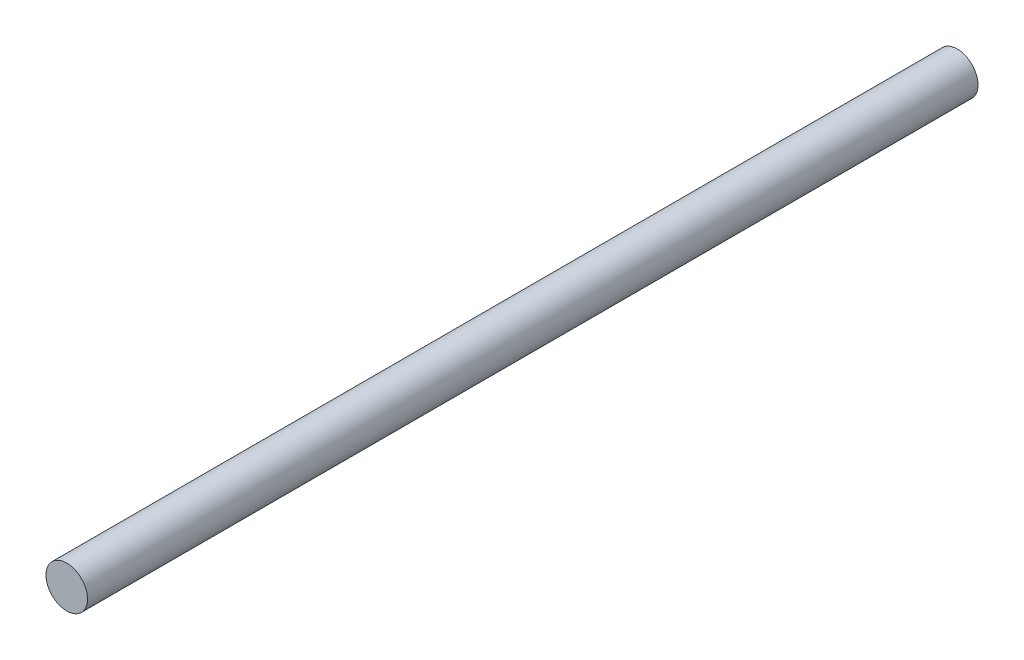
ISO-10303-21;
HEADER;
FILE_DESCRIPTION(('STEP AP214'),'2;1');
FILE_NAME('part.step','',(''),(''),'','','');
FILE_SCHEMA(('AUTOMOTIVE_DESIGN { 1 0 10303 214 1 1 1 1 }'));
ENDSEC;
DATA;
#1=APPLICATION_CONTEXT('core data for automotive mechanical design processes');
#2=APPLICATION_PROTOCOL_DEFINITION('international standard','automotive_design',2000,#1);
#3=PRODUCT_CONTEXT('',#1,'mechanical');
#4=PRODUCT('Part','Part','',(#3));
#5=PRODUCT_RELATED_PRODUCT_CATEGORY('part','',(#4));
#6=PRODUCT_DEFINITION_FORMATION('','',#4);
#7=PRODUCT_DEFINITION_CONTEXT('part definition',#1,'design');
#8=PRODUCT_DEFINITION('design','',#6,#7);
#9=PRODUCT_DEFINITION_SHAPE('','',#8);
#10=(LENGTH_UNIT() NAMED_UNIT(*) SI_UNIT(.MILLI.,.METRE.));
#11=(NAMED_UNIT(*) PLANE_ANGLE_UNIT() SI_UNIT($,.RADIAN.));
#12=(NAMED_UNIT(*) SI_UNIT($,.STERADIAN.) SOLID_ANGLE_UNIT());
#13=UNCERTAINTY_MEASURE_WITH_UNIT(LENGTH_MEASURE(1.E-05),#10,'distance_accuracy_value','');
#14=(GEOMETRIC_REPRESENTATION_CONTEXT(3) GLOBAL_UNCERTAINTY_ASSIGNED_CONTEXT((#13)) GLOBAL_UNIT_ASSIGNED_CONTEXT((#10,
#11,#12)) REPRESENTATION_CONTEXT('',''));
#15=CARTESIAN_POINT('',(0.,0.,0.));
#16=DIRECTION('',(0.,0.,1.));
#17=DIRECTION('',(1.,0.,0.));
#18=AXIS2_PLACEMENT_3D('',#15,#16,#17);
#19=CARTESIAN_POINT('',(0.,0.,38.1));
#20=DIRECTION('',(0.,0.,-1.));
#21=DIRECTION('',(-1.,0.,0.));
#22=AXIS2_PLACEMENT_3D('',#19,#20,#21);
#23=CYLINDRICAL_SURFACE('',#22,0.889);
#24=CARTESIAN_POINT('',(0.,0.,38.1));
#25=DIRECTION('',(0.,0.,1.));
#26=DIRECTION('',(1.,0.,0.));
#27=AXIS2_PLACEMENT_3D('',#24,#25,#26);
#28=CIRCLE('',#27,0.889);
#29=CARTESIAN_POINT('',(0.889,0.,38.1));
#30=VERTEX_POINT('',#29);
#31=EDGE_CURVE('E10',#30,#30,#28,.T.);
#32=ORIENTED_EDGE('',*,*,#31,.F.);
#33=EDGE_LOOP('',(#32));
#34=FACE_BOUND('',#33,.T.);
#35=CARTESIAN_POINT('',(0.,0.,0.));
#36=DIRECTION('',(0.,0.,1.));
#37=DIRECTION('',(1.,0.,0.));
#38=AXIS2_PLACEMENT_3D('',#35,#36,#37);
#39=CIRCLE('',#38,0.889);
#40=CARTESIAN_POINT('',(0.889,0.,0.));
#41=VERTEX_POINT('',#40);
#42=EDGE_CURVE('E38',#41,#41,#39,.T.);
#43=ORIENTED_EDGE('',*,*,#42,.T.);
#44=EDGE_LOOP('',(#43));
#45=FACE_BOUND('',#44,.T.);
#46=ADVANCED_FACE('F35',(#34,#45),#23,.T.);
#47=CARTESIAN_POINT('',(0.,0.,38.1));
#48=DIRECTION('',(0.,0.,1.));
#49=DIRECTION('',(1.,0.,0.));
#50=AXIS2_PLACEMENT_3D('',#47,#48,#49);
#51=PLANE('',#50);
#52=ORIENTED_EDGE('',*,*,#31,.T.);
#53=EDGE_LOOP('',(#52));
#54=FACE_BOUND('',#53,.T.);
#55=ADVANCED_FACE('F50',(#54),#51,.T.);
#56=CARTESIAN_POINT('',(0.,0.,0.));
#57=DIRECTION('',(0.,0.,1.));
#58=DIRECTION('',(1.,0.,0.));
#59=AXIS2_PLACEMENT_3D('',#56,#57,#58);
#60=PLANE('',#59);
#61=ORIENTED_EDGE('',*,*,#42,.F.);
#62=EDGE_LOOP('',(#61));
#63=FACE_BOUND('',#62,.T.);
#64=ADVANCED_FACE('F48',(#63),#60,.F.);
#65=CLOSED_SHELL('',(#46,#55,#64));
#66=MANIFOLD_SOLID_BREP('B2',#65);
#67=ADVANCED_BREP_SHAPE_REPRESENTATION('',(#18,#66),#14);
#68=SHAPE_DEFINITION_REPRESENTATION(#9,#67);
ENDSEC;
END-ISO-10303-21;
